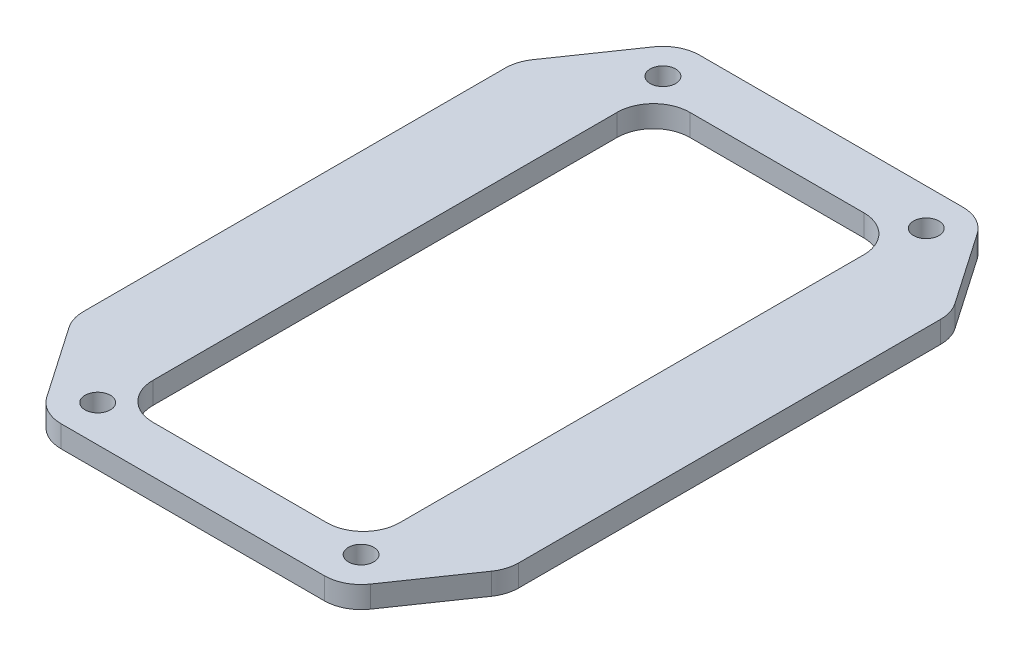
ISO-10303-21;
HEADER;
FILE_DESCRIPTION(('STEP AP214'),'2;1');
FILE_NAME('part.step','',(''),(''),'','','');
FILE_SCHEMA(('AUTOMOTIVE_DESIGN { 1 0 10303 214 1 1 1 1 }'));
ENDSEC;
DATA;
#1=APPLICATION_CONTEXT('core data for automotive mechanical design processes');
#2=APPLICATION_PROTOCOL_DEFINITION('international standard','automotive_design',2000,#1);
#3=PRODUCT_CONTEXT('',#1,'mechanical');
#4=PRODUCT('Part','Part','',(#3));
#5=PRODUCT_RELATED_PRODUCT_CATEGORY('part','',(#4));
#6=PRODUCT_DEFINITION_FORMATION('','',#4);
#7=PRODUCT_DEFINITION_CONTEXT('part definition',#1,'design');
#8=PRODUCT_DEFINITION('design','',#6,#7);
#9=PRODUCT_DEFINITION_SHAPE('','',#8);
#10=(LENGTH_UNIT() NAMED_UNIT(*) SI_UNIT(.MILLI.,.METRE.));
#11=(NAMED_UNIT(*) PLANE_ANGLE_UNIT() SI_UNIT($,.RADIAN.));
#12=(NAMED_UNIT(*) SI_UNIT($,.STERADIAN.) SOLID_ANGLE_UNIT());
#13=UNCERTAINTY_MEASURE_WITH_UNIT(LENGTH_MEASURE(1.E-05),#10,'distance_accuracy_value','');
#14=(GEOMETRIC_REPRESENTATION_CONTEXT(3) GLOBAL_UNCERTAINTY_ASSIGNED_CONTEXT((#13)) GLOBAL_UNIT_ASSIGNED_CONTEXT((#10,
#11,#12)) REPRESENTATION_CONTEXT('',''));
#15=CARTESIAN_POINT('',(0.,0.,0.));
#16=DIRECTION('',(0.,0.,1.));
#17=DIRECTION('',(1.,0.,0.));
#18=AXIS2_PLACEMENT_3D('',#15,#16,#17);
#19=CARTESIAN_POINT('',(0.,3.,0.));
#20=DIRECTION('',(0.,-1.,0.));
#21=DIRECTION('',(0.,0.,-1.));
#22=AXIS2_PLACEMENT_3D('',#19,#20,#21);
#23=PLANE('',#22);
#24=CARTESIAN_POINT('',(11.85,3.,-5.04999999999999));
#25=DIRECTION('',(0.,1.,0.));
#26=DIRECTION('',(0.,0.,1.));
#27=AXIS2_PLACEMENT_3D('',#24,#25,#26);
#28=CIRCLE('',#27,1.75);
#29=CARTESIAN_POINT('',(11.85,3.,-3.29999999999999));
#30=VERTEX_POINT('',#29);
#31=EDGE_CURVE('E477',#30,#30,#28,.T.);
#32=ORIENTED_EDGE('',*,*,#31,.F.);
#33=EDGE_LOOP('',(#32));
#34=FACE_BOUND('',#33,.T.);
#35=CARTESIAN_POINT('',(11.85,3.,-82.95));
#36=DIRECTION('',(0.,1.,0.));
#37=DIRECTION('',(0.,0.,1.));
#38=AXIS2_PLACEMENT_3D('',#35,#36,#37);
#39=CIRCLE('',#38,1.75);
#40=CARTESIAN_POINT('',(11.85,3.,-81.2));
#41=VERTEX_POINT('',#40);
#42=EDGE_CURVE('E485',#41,#41,#39,.T.);
#43=ORIENTED_EDGE('',*,*,#42,.F.);
#44=EDGE_LOOP('',(#43));
#45=FACE_BOUND('',#44,.T.);
#46=CARTESIAN_POINT('',(48.15,3.,-5.05000000000003));
#47=DIRECTION('',(0.,1.,0.));
#48=DIRECTION('',(0.,0.,1.));
#49=AXIS2_PLACEMENT_3D('',#46,#47,#48);
#50=CIRCLE('',#49,1.75);
#51=CARTESIAN_POINT('',(48.15,3.,-3.30000000000003));
#52=VERTEX_POINT('',#51);
#53=EDGE_CURVE('E493',#52,#52,#50,.T.);
#54=ORIENTED_EDGE('',*,*,#53,.F.);
#55=EDGE_LOOP('',(#54));
#56=FACE_BOUND('',#55,.T.);
#57=CARTESIAN_POINT('',(48.15,3.,-82.95));
#58=DIRECTION('',(0.,1.,0.));
#59=DIRECTION('',(0.,0.,1.));
#60=AXIS2_PLACEMENT_3D('',#57,#58,#59);
#61=CIRCLE('',#60,1.75);
#62=CARTESIAN_POINT('',(48.15,3.,-81.2));
#63=VERTEX_POINT('',#62);
#64=EDGE_CURVE('E407',#63,#63,#61,.T.);
#65=ORIENTED_EDGE('',*,*,#64,.F.);
#66=EDGE_LOOP('',(#65));
#67=FACE_BOUND('',#66,.T.);
#68=DIRECTION('',(0.,0.,1.));
#69=VECTOR('',#68,1.);
#70=CARTESIAN_POINT('',(13.,3.,-80.5));
#71=LINE('',#70,#69);
#72=CARTESIAN_POINT('',(13.,3.,-75.5));
#73=VERTEX_POINT('',#72);
#74=CARTESIAN_POINT('',(13.,3.,-11.5));
#75=VERTEX_POINT('',#74);
#76=EDGE_CURVE('E452',#73,#75,#71,.T.);
#77=ORIENTED_EDGE('',*,*,#76,.F.);
#78=CARTESIAN_POINT('',(18.,3.,-75.5));
#79=DIRECTION('',(0.,-1.,0.));
#80=DIRECTION('',(0.,0.,-1.));
#81=AXIS2_PLACEMENT_3D('',#78,#79,#80);
#82=CIRCLE('',#81,5.);
#83=CARTESIAN_POINT('',(18.,3.,-80.5));
#84=VERTEX_POINT('',#83);
#85=EDGE_CURVE('E277',#73,#84,#82,.T.);
#86=ORIENTED_EDGE('',*,*,#85,.T.);
#87=DIRECTION('',(-1.,0.,0.));
#88=VECTOR('',#87,1.);
#89=CARTESIAN_POINT('',(13.,3.,-80.5));
#90=LINE('',#89,#88);
#91=CARTESIAN_POINT('',(42.,3.,-80.5));
#92=VERTEX_POINT('',#91);
#93=EDGE_CURVE('E463',#92,#84,#90,.T.);
#94=ORIENTED_EDGE('',*,*,#93,.F.);
#95=CARTESIAN_POINT('',(42.,3.,-75.5));
#96=DIRECTION('',(0.,-1.,0.));
#97=DIRECTION('',(0.,0.,-1.));
#98=AXIS2_PLACEMENT_3D('',#95,#96,#97);
#99=CIRCLE('',#98,5.);
#100=CARTESIAN_POINT('',(47.,3.,-75.5));
#101=VERTEX_POINT('',#100);
#102=EDGE_CURVE('E213',#92,#101,#99,.T.);
#103=ORIENTED_EDGE('',*,*,#102,.T.);
#104=DIRECTION('',(0.,0.,-1.));
#105=VECTOR('',#104,1.);
#106=CARTESIAN_POINT('',(47.,3.,-80.5));
#107=LINE('',#106,#105);
#108=CARTESIAN_POINT('',(47.,3.,-11.5));
#109=VERTEX_POINT('',#108);
#110=EDGE_CURVE('E460',#109,#101,#107,.T.);
#111=ORIENTED_EDGE('',*,*,#110,.F.);
#112=CARTESIAN_POINT('',(42.,3.,-11.5));
#113=DIRECTION('',(0.,-1.,0.));
#114=DIRECTION('',(0.,0.,-1.));
#115=AXIS2_PLACEMENT_3D('',#112,#113,#114);
#116=CIRCLE('',#115,5.);
#117=CARTESIAN_POINT('',(42.,3.,-6.49999999999999));
#118=VERTEX_POINT('',#117);
#119=EDGE_CURVE('E212',#109,#118,#116,.T.);
#120=ORIENTED_EDGE('',*,*,#119,.T.);
#121=DIRECTION('',(1.,0.,0.));
#122=VECTOR('',#121,1.);
#123=CARTESIAN_POINT('',(13.,3.,-6.49999999999999));
#124=LINE('',#123,#122);
#125=CARTESIAN_POINT('',(18.,3.,-6.49999999999999));
#126=VERTEX_POINT('',#125);
#127=EDGE_CURVE('E456',#126,#118,#124,.T.);
#128=ORIENTED_EDGE('',*,*,#127,.F.);
#129=CARTESIAN_POINT('',(18.,3.,-11.5));
#130=DIRECTION('',(0.,-1.,0.));
#131=DIRECTION('',(0.,0.,-1.));
#132=AXIS2_PLACEMENT_3D('',#129,#130,#131);
#133=CIRCLE('',#132,5.);
#134=EDGE_CURVE('E271',#126,#75,#133,.T.);
#135=ORIENTED_EDGE('',*,*,#134,.T.);
#136=EDGE_LOOP('',(#77,#86,#94,#103,#111,#120,#128,#135));
#137=FACE_BOUND('',#136,.T.);
#138=DIRECTION('',(-0.56730108222644,0.,0.823510462656493));
#139=VECTOR('',#138,1.);
#140=CARTESIAN_POINT('',(9.1965673675746,3.,-88.));
#141=LINE('',#140,#139);
#142=CARTESIAN_POINT('',(7.69127216358472,3.,-85.8148704652435));
#143=VERTEX_POINT('',#142);
#144=CARTESIAN_POINT('',(0.891272163584712,3.,-75.9437961424398));
#145=VERTEX_POINT('',#144);
#146=EDGE_CURVE('E429',#143,#145,#141,.T.);
#147=ORIENTED_EDGE('',*,*,#146,.T.);
#148=CARTESIAN_POINT('',(5.05,3.,-73.0789256771963));
#149=DIRECTION('',(0.,-1.,0.));
#150=DIRECTION('',(0.,0.,-1.));
#151=AXIS2_PLACEMENT_3D('',#148,#149,#150);
#152=CIRCLE('',#151,5.05);
#153=CARTESIAN_POINT('',(0.,3.,-73.0789256771963));
#154=VERTEX_POINT('',#153);
#155=EDGE_CURVE('E308',#145,#154,#152,.F.);
#156=ORIENTED_EDGE('',*,*,#155,.T.);
#157=DIRECTION('',(0.,0.,1.));
#158=VECTOR('',#157,1.);
#159=CARTESIAN_POINT('',(0.,3.,0.));
#160=LINE('',#159,#158);
#161=CARTESIAN_POINT('',(0.,3.,-14.9210743228037));
#162=VERTEX_POINT('',#161);
#163=EDGE_CURVE('E393',#154,#162,#160,.T.);
#164=ORIENTED_EDGE('',*,*,#163,.T.);
#165=CARTESIAN_POINT('',(5.05,3.,-14.9210743228037));
#166=DIRECTION('',(0.,-1.,0.));
#167=DIRECTION('',(0.,0.,-1.));
#168=AXIS2_PLACEMENT_3D('',#165,#166,#167);
#169=CIRCLE('',#168,5.05);
#170=CARTESIAN_POINT('',(0.891272163584712,3.,-12.0562038575602));
#171=VERTEX_POINT('',#170);
#172=EDGE_CURVE('E287',#162,#171,#169,.F.);
#173=ORIENTED_EDGE('',*,*,#172,.T.);
#174=DIRECTION('',(0.567301082226439,0.,0.823510462656493));
#175=VECTOR('',#174,1.);
#176=CARTESIAN_POINT('',(0.,3.,-13.35));
#177=LINE('',#176,#175);
#178=CARTESIAN_POINT('',(7.69127216358472,3.,-2.18512953475648));
#179=VERTEX_POINT('',#178);
#180=EDGE_CURVE('E436',#171,#179,#177,.T.);
#181=ORIENTED_EDGE('',*,*,#180,.T.);
#182=CARTESIAN_POINT('',(11.85,3.,-5.05));
#183=DIRECTION('',(0.,-1.,0.));
#184=DIRECTION('',(0.,0.,-1.));
#185=AXIS2_PLACEMENT_3D('',#182,#183,#184);
#186=CIRCLE('',#185,5.05);
#187=CARTESIAN_POINT('',(11.85,3.,0.));
#188=VERTEX_POINT('',#187);
#189=EDGE_CURVE('E290',#179,#188,#186,.F.);
#190=ORIENTED_EDGE('',*,*,#189,.T.);
#191=DIRECTION('',(1.,0.,0.));
#192=VECTOR('',#191,1.);
#193=CARTESIAN_POINT('',(0.,3.,0.));
#194=LINE('',#193,#192);
#195=CARTESIAN_POINT('',(48.15,3.,0.));
#196=VERTEX_POINT('',#195);
#197=EDGE_CURVE('E382',#188,#196,#194,.T.);
#198=ORIENTED_EDGE('',*,*,#197,.T.);
#199=CARTESIAN_POINT('',(48.15,3.,-5.05));
#200=DIRECTION('',(0.,-1.,0.));
#201=DIRECTION('',(0.,0.,-1.));
#202=AXIS2_PLACEMENT_3D('',#199,#200,#201);
#203=CIRCLE('',#202,5.05);
#204=CARTESIAN_POINT('',(52.3087278364153,3.,-2.18512953475648));
#205=VERTEX_POINT('',#204);
#206=EDGE_CURVE('E293',#196,#205,#203,.F.);
#207=ORIENTED_EDGE('',*,*,#206,.T.);
#208=DIRECTION('',(0.56730108222644,0.,-0.823510462656493));
#209=VECTOR('',#208,1.);
#210=CARTESIAN_POINT('',(50.8034326324254,3.,0.));
#211=LINE('',#210,#209);
#212=CARTESIAN_POINT('',(59.1087278364153,3.,-12.0562038575602));
#213=VERTEX_POINT('',#212);
#214=EDGE_CURVE('E439',#205,#213,#211,.T.);
#215=ORIENTED_EDGE('',*,*,#214,.T.);
#216=CARTESIAN_POINT('',(54.95,3.,-14.9210743228037));
#217=DIRECTION('',(0.,-1.,0.));
#218=DIRECTION('',(0.,0.,-1.));
#219=AXIS2_PLACEMENT_3D('',#216,#217,#218);
#220=CIRCLE('',#219,5.05);
#221=CARTESIAN_POINT('',(60.,3.,-14.9210743228037));
#222=VERTEX_POINT('',#221);
#223=EDGE_CURVE('E296',#213,#222,#220,.F.);
#224=ORIENTED_EDGE('',*,*,#223,.T.);
#225=DIRECTION('',(0.,0.,-1.));
#226=VECTOR('',#225,1.);
#227=CARTESIAN_POINT('',(60.,3.,0.));
#228=LINE('',#227,#226);
#229=CARTESIAN_POINT('',(60.,3.,-73.0789256771963));
#230=VERTEX_POINT('',#229);
#231=EDGE_CURVE('E236',#222,#230,#228,.T.);
#232=ORIENTED_EDGE('',*,*,#231,.T.);
#233=CARTESIAN_POINT('',(54.95,3.,-73.0789256771963));
#234=DIRECTION('',(0.,-1.,0.));
#235=DIRECTION('',(0.,0.,-1.));
#236=AXIS2_PLACEMENT_3D('',#233,#234,#235);
#237=CIRCLE('',#236,5.05);
#238=CARTESIAN_POINT('',(59.1087278364153,3.,-75.9437961424398));
#239=VERTEX_POINT('',#238);
#240=EDGE_CURVE('E299',#230,#239,#237,.F.);
#241=ORIENTED_EDGE('',*,*,#240,.T.);
#242=DIRECTION('',(-0.56730108222644,0.,-0.823510462656493));
#243=VECTOR('',#242,1.);
#244=CARTESIAN_POINT('',(60.,3.,-74.65));
#245=LINE('',#244,#243);
#246=CARTESIAN_POINT('',(52.3087278364153,3.,-85.8148704652435));
#247=VERTEX_POINT('',#246);
#248=EDGE_CURVE('E447',#239,#247,#245,.T.);
#249=ORIENTED_EDGE('',*,*,#248,.T.);
#250=CARTESIAN_POINT('',(48.15,3.,-82.95));
#251=DIRECTION('',(0.,-1.,0.));
#252=DIRECTION('',(0.,0.,-1.));
#253=AXIS2_PLACEMENT_3D('',#250,#251,#252);
#254=CIRCLE('',#253,5.05);
#255=CARTESIAN_POINT('',(48.15,3.,-88.));
#256=VERTEX_POINT('',#255);
#257=EDGE_CURVE('E302',#247,#256,#254,.F.);
#258=ORIENTED_EDGE('',*,*,#257,.T.);
#259=DIRECTION('',(-1.,0.,0.));
#260=VECTOR('',#259,1.);
#261=CARTESIAN_POINT('',(0.,3.,-88.));
#262=LINE('',#261,#260);
#263=CARTESIAN_POINT('',(11.85,3.,-88.));
#264=VERTEX_POINT('',#263);
#265=EDGE_CURVE('E229',#256,#264,#262,.T.);
#266=ORIENTED_EDGE('',*,*,#265,.T.);
#267=CARTESIAN_POINT('',(11.85,3.,-82.95));
#268=DIRECTION('',(0.,-1.,0.));
#269=DIRECTION('',(0.,0.,-1.));
#270=AXIS2_PLACEMENT_3D('',#267,#268,#269);
#271=CIRCLE('',#270,5.05);
#272=EDGE_CURVE('E305',#264,#143,#271,.F.);
#273=ORIENTED_EDGE('',*,*,#272,.T.);
#274=EDGE_LOOP('',(#147,#156,#164,#173,#181,#190,#198,#207,#215,#224,#232,#241,#249,#258,#266,#273));
#275=FACE_BOUND('',#274,.T.);
#276=ADVANCED_FACE('F38',(#34,#45,#56,#67,#137,#275),#23,.F.);
#277=CARTESIAN_POINT('',(0.,0.,0.));
#278=DIRECTION('',(0.,-1.,0.));
#279=DIRECTION('',(0.,0.,-1.));
#280=AXIS2_PLACEMENT_3D('',#277,#278,#279);
#281=PLANE('',#280);
#282=CARTESIAN_POINT('',(11.85,0.,-82.95));
#283=DIRECTION('',(0.,1.,0.));
#284=DIRECTION('',(0.,0.,1.));
#285=AXIS2_PLACEMENT_3D('',#282,#283,#284);
#286=CIRCLE('',#285,1.75);
#287=CARTESIAN_POINT('',(11.85,0.,-81.2));
#288=VERTEX_POINT('',#287);
#289=EDGE_CURVE('E481',#288,#288,#286,.T.);
#290=ORIENTED_EDGE('',*,*,#289,.T.);
#291=EDGE_LOOP('',(#290));
#292=FACE_BOUND('',#291,.T.);
#293=CARTESIAN_POINT('',(48.15,0.,-82.95));
#294=DIRECTION('',(0.,1.,0.));
#295=DIRECTION('',(0.,0.,1.));
#296=AXIS2_PLACEMENT_3D('',#293,#294,#295);
#297=CIRCLE('',#296,1.75);
#298=CARTESIAN_POINT('',(48.15,0.,-81.2));
#299=VERTEX_POINT('',#298);
#300=EDGE_CURVE('E497',#299,#299,#297,.T.);
#301=ORIENTED_EDGE('',*,*,#300,.T.);
#302=EDGE_LOOP('',(#301));
#303=FACE_BOUND('',#302,.T.);
#304=CARTESIAN_POINT('',(48.15,0.,-5.05000000000003));
#305=DIRECTION('',(0.,1.,0.));
#306=DIRECTION('',(0.,0.,1.));
#307=AXIS2_PLACEMENT_3D('',#304,#305,#306);
#308=CIRCLE('',#307,1.75);
#309=CARTESIAN_POINT('',(48.15,0.,-3.30000000000003));
#310=VERTEX_POINT('',#309);
#311=EDGE_CURVE('E489',#310,#310,#308,.T.);
#312=ORIENTED_EDGE('',*,*,#311,.T.);
#313=EDGE_LOOP('',(#312));
#314=FACE_BOUND('',#313,.T.);
#315=CARTESIAN_POINT('',(11.85,0.,-5.04999999999999));
#316=DIRECTION('',(0.,1.,0.));
#317=DIRECTION('',(0.,0.,1.));
#318=AXIS2_PLACEMENT_3D('',#315,#316,#317);
#319=CIRCLE('',#318,1.75);
#320=CARTESIAN_POINT('',(11.85,0.,-3.29999999999999));
#321=VERTEX_POINT('',#320);
#322=EDGE_CURVE('E467',#321,#321,#319,.T.);
#323=ORIENTED_EDGE('',*,*,#322,.T.);
#324=EDGE_LOOP('',(#323));
#325=FACE_BOUND('',#324,.T.);
#326=DIRECTION('',(0.,0.,-1.));
#327=VECTOR('',#326,1.);
#328=CARTESIAN_POINT('',(47.,0.,-80.5));
#329=LINE('',#328,#327);
#330=CARTESIAN_POINT('',(47.,0.,-11.5));
#331=VERTEX_POINT('',#330);
#332=CARTESIAN_POINT('',(47.,0.,-75.5));
#333=VERTEX_POINT('',#332);
#334=EDGE_CURVE('E204',#331,#333,#329,.T.);
#335=ORIENTED_EDGE('',*,*,#334,.T.);
#336=CARTESIAN_POINT('',(42.,0.,-75.5));
#337=DIRECTION('',(0.,-1.,0.));
#338=DIRECTION('',(0.,0.,-1.));
#339=AXIS2_PLACEMENT_3D('',#336,#337,#338);
#340=CIRCLE('',#339,5.);
#341=CARTESIAN_POINT('',(42.,0.,-80.5));
#342=VERTEX_POINT('',#341);
#343=EDGE_CURVE('E261',#333,#342,#340,.F.);
#344=ORIENTED_EDGE('',*,*,#343,.T.);
#345=DIRECTION('',(-1.,0.,0.));
#346=VECTOR('',#345,1.);
#347=CARTESIAN_POINT('',(13.,0.,-80.5));
#348=LINE('',#347,#346);
#349=CARTESIAN_POINT('',(18.,0.,-80.5));
#350=VERTEX_POINT('',#349);
#351=EDGE_CURVE('E224',#342,#350,#348,.T.);
#352=ORIENTED_EDGE('',*,*,#351,.T.);
#353=CARTESIAN_POINT('',(18.,0.,-75.5));
#354=DIRECTION('',(0.,-1.,0.));
#355=DIRECTION('',(0.,0.,-1.));
#356=AXIS2_PLACEMENT_3D('',#353,#354,#355);
#357=CIRCLE('',#356,5.);
#358=CARTESIAN_POINT('',(13.,0.,-75.5));
#359=VERTEX_POINT('',#358);
#360=EDGE_CURVE('E274',#350,#359,#357,.F.);
#361=ORIENTED_EDGE('',*,*,#360,.T.);
#362=DIRECTION('',(0.,0.,1.));
#363=VECTOR('',#362,1.);
#364=CARTESIAN_POINT('',(13.,0.,-80.5));
#365=LINE('',#364,#363);
#366=CARTESIAN_POINT('',(13.,0.,-11.5));
#367=VERTEX_POINT('',#366);
#368=EDGE_CURVE('E468',#359,#367,#365,.T.);
#369=ORIENTED_EDGE('',*,*,#368,.T.);
#370=CARTESIAN_POINT('',(18.,0.,-11.5));
#371=DIRECTION('',(0.,-1.,0.));
#372=DIRECTION('',(0.,0.,-1.));
#373=AXIS2_PLACEMENT_3D('',#370,#371,#372);
#374=CIRCLE('',#373,5.);
#375=CARTESIAN_POINT('',(18.,0.,-6.49999999999999));
#376=VERTEX_POINT('',#375);
#377=EDGE_CURVE('E268',#367,#376,#374,.F.);
#378=ORIENTED_EDGE('',*,*,#377,.T.);
#379=DIRECTION('',(1.,0.,0.));
#380=VECTOR('',#379,1.);
#381=CARTESIAN_POINT('',(13.,0.,-6.49999999999999));
#382=LINE('',#381,#380);
#383=CARTESIAN_POINT('',(42.,0.,-6.49999999999999));
#384=VERTEX_POINT('',#383);
#385=EDGE_CURVE('E206',#376,#384,#382,.T.);
#386=ORIENTED_EDGE('',*,*,#385,.T.);
#387=CARTESIAN_POINT('',(42.,0.,-11.5));
#388=DIRECTION('',(0.,-1.,0.));
#389=DIRECTION('',(0.,0.,-1.));
#390=AXIS2_PLACEMENT_3D('',#387,#388,#389);
#391=CIRCLE('',#390,5.);
#392=EDGE_CURVE('E201',#384,#331,#391,.F.);
#393=ORIENTED_EDGE('',*,*,#392,.T.);
#394=EDGE_LOOP('',(#335,#344,#352,#361,#369,#378,#386,#393));
#395=FACE_BOUND('',#394,.T.);
#396=DIRECTION('',(0.,0.,1.));
#397=VECTOR('',#396,1.);
#398=CARTESIAN_POINT('',(0.,0.,0.));
#399=LINE('',#398,#397);
#400=CARTESIAN_POINT('',(0.,0.,-73.0789256771963));
#401=VERTEX_POINT('',#400);
#402=CARTESIAN_POINT('',(0.,0.,-14.9210743228037));
#403=VERTEX_POINT('',#402);
#404=EDGE_CURVE('E403',#401,#403,#399,.T.);
#405=ORIENTED_EDGE('',*,*,#404,.F.);
#406=CARTESIAN_POINT('',(5.05,0.,-73.0789256771963));
#407=DIRECTION('',(0.,-1.,0.));
#408=DIRECTION('',(0.,0.,-1.));
#409=AXIS2_PLACEMENT_3D('',#406,#407,#408);
#410=CIRCLE('',#409,5.05);
#411=CARTESIAN_POINT('',(0.891272163584712,0.,-75.9437961424398));
#412=VERTEX_POINT('',#411);
#413=EDGE_CURVE('E338',#401,#412,#410,.T.);
#414=ORIENTED_EDGE('',*,*,#413,.T.);
#415=DIRECTION('',(-0.56730108222644,0.,0.823510462656493));
#416=VECTOR('',#415,1.);
#417=CARTESIAN_POINT('',(9.1965673675746,0.,-88.));
#418=LINE('',#417,#416);
#419=CARTESIAN_POINT('',(7.69127216358472,0.,-85.8148704652435));
#420=VERTEX_POINT('',#419);
#421=EDGE_CURVE('E451',#420,#412,#418,.T.);
#422=ORIENTED_EDGE('',*,*,#421,.F.);
#423=CARTESIAN_POINT('',(11.85,0.,-82.95));
#424=DIRECTION('',(0.,-1.,0.));
#425=DIRECTION('',(0.,0.,-1.));
#426=AXIS2_PLACEMENT_3D('',#423,#424,#425);
#427=CIRCLE('',#426,5.05);
#428=CARTESIAN_POINT('',(11.85,0.,-88.));
#429=VERTEX_POINT('',#428);
#430=EDGE_CURVE('E335',#420,#429,#427,.T.);
#431=ORIENTED_EDGE('',*,*,#430,.T.);
#432=DIRECTION('',(-1.,0.,0.));
#433=VECTOR('',#432,1.);
#434=CARTESIAN_POINT('',(0.,0.,-88.));
#435=LINE('',#434,#433);
#436=CARTESIAN_POINT('',(48.15,0.,-88.));
#437=VERTEX_POINT('',#436);
#438=EDGE_CURVE('E239',#437,#429,#435,.T.);
#439=ORIENTED_EDGE('',*,*,#438,.F.);
#440=CARTESIAN_POINT('',(48.15,0.,-82.95));
#441=DIRECTION('',(0.,-1.,0.));
#442=DIRECTION('',(0.,0.,-1.));
#443=AXIS2_PLACEMENT_3D('',#440,#441,#442);
#444=CIRCLE('',#443,5.05);
#445=CARTESIAN_POINT('',(52.3087278364153,0.,-85.8148704652435));
#446=VERTEX_POINT('',#445);
#447=EDGE_CURVE('E332',#437,#446,#444,.T.);
#448=ORIENTED_EDGE('',*,*,#447,.T.);
#449=DIRECTION('',(-0.56730108222644,0.,-0.823510462656493));
#450=VECTOR('',#449,1.);
#451=CARTESIAN_POINT('',(60.,0.,-74.65));
#452=LINE('',#451,#450);
#453=CARTESIAN_POINT('',(59.1087278364153,0.,-75.9437961424398));
#454=VERTEX_POINT('',#453);
#455=EDGE_CURVE('E442',#454,#446,#452,.T.);
#456=ORIENTED_EDGE('',*,*,#455,.F.);
#457=CARTESIAN_POINT('',(54.95,0.,-73.0789256771963));
#458=DIRECTION('',(0.,-1.,0.));
#459=DIRECTION('',(0.,0.,-1.));
#460=AXIS2_PLACEMENT_3D('',#457,#458,#459);
#461=CIRCLE('',#460,5.05);
#462=CARTESIAN_POINT('',(60.,0.,-73.0789256771963));
#463=VERTEX_POINT('',#462);
#464=EDGE_CURVE('E329',#454,#463,#461,.T.);
#465=ORIENTED_EDGE('',*,*,#464,.T.);
#466=DIRECTION('',(0.,0.,-1.));
#467=VECTOR('',#466,1.);
#468=CARTESIAN_POINT('',(60.,0.,0.));
#469=LINE('',#468,#467);
#470=CARTESIAN_POINT('',(60.,0.,-14.9210743228037));
#471=VERTEX_POINT('',#470);
#472=EDGE_CURVE('E409',#471,#463,#469,.T.);
#473=ORIENTED_EDGE('',*,*,#472,.F.);
#474=CARTESIAN_POINT('',(54.95,0.,-14.9210743228037));
#475=DIRECTION('',(0.,-1.,0.));
#476=DIRECTION('',(0.,0.,-1.));
#477=AXIS2_PLACEMENT_3D('',#474,#475,#476);
#478=CIRCLE('',#477,5.05);
#479=CARTESIAN_POINT('',(59.1087278364153,0.,-12.0562038575602));
#480=VERTEX_POINT('',#479);
#481=EDGE_CURVE('E326',#471,#480,#478,.T.);
#482=ORIENTED_EDGE('',*,*,#481,.T.);
#483=DIRECTION('',(0.56730108222644,0.,-0.823510462656493));
#484=VECTOR('',#483,1.);
#485=CARTESIAN_POINT('',(50.8034326324254,0.,0.));
#486=LINE('',#485,#484);
#487=CARTESIAN_POINT('',(52.3087278364153,0.,-2.18512953475648));
#488=VERTEX_POINT('',#487);
#489=EDGE_CURVE('E594',#488,#480,#486,.T.);
#490=ORIENTED_EDGE('',*,*,#489,.F.);
#491=CARTESIAN_POINT('',(48.15,0.,-5.05));
#492=DIRECTION('',(0.,-1.,0.));
#493=DIRECTION('',(0.,0.,-1.));
#494=AXIS2_PLACEMENT_3D('',#491,#492,#493);
#495=CIRCLE('',#494,5.05);
#496=CARTESIAN_POINT('',(48.15,0.,0.));
#497=VERTEX_POINT('',#496);
#498=EDGE_CURVE('E323',#488,#497,#495,.T.);
#499=ORIENTED_EDGE('',*,*,#498,.T.);
#500=DIRECTION('',(1.,0.,0.));
#501=VECTOR('',#500,1.);
#502=CARTESIAN_POINT('',(0.,0.,0.));
#503=LINE('',#502,#501);
#504=CARTESIAN_POINT('',(11.85,0.,0.));
#505=VERTEX_POINT('',#504);
#506=EDGE_CURVE('E384',#505,#497,#503,.T.);
#507=ORIENTED_EDGE('',*,*,#506,.F.);
#508=CARTESIAN_POINT('',(11.85,0.,-5.05));
#509=DIRECTION('',(0.,-1.,0.));
#510=DIRECTION('',(0.,0.,-1.));
#511=AXIS2_PLACEMENT_3D('',#508,#509,#510);
#512=CIRCLE('',#511,5.05);
#513=CARTESIAN_POINT('',(7.69127216358472,0.,-2.18512953475648));
#514=VERTEX_POINT('',#513);
#515=EDGE_CURVE('E54',#505,#514,#512,.T.);
#516=ORIENTED_EDGE('',*,*,#515,.T.);
#517=DIRECTION('',(0.567301082226439,0.,0.823510462656493));
#518=VECTOR('',#517,1.);
#519=CARTESIAN_POINT('',(0.,0.,-13.35));
#520=LINE('',#519,#518);
#521=CARTESIAN_POINT('',(0.891272163584712,0.,-12.0562038575602));
#522=VERTEX_POINT('',#521);
#523=EDGE_CURVE('E586',#522,#514,#520,.T.);
#524=ORIENTED_EDGE('',*,*,#523,.F.);
#525=CARTESIAN_POINT('',(5.05,0.,-14.9210743228037));
#526=DIRECTION('',(0.,-1.,0.));
#527=DIRECTION('',(0.,0.,-1.));
#528=AXIS2_PLACEMENT_3D('',#525,#526,#527);
#529=CIRCLE('',#528,5.05);
#530=EDGE_CURVE('E318',#522,#403,#529,.T.);
#531=ORIENTED_EDGE('',*,*,#530,.T.);
#532=EDGE_LOOP('',(#405,#414,#422,#431,#439,#448,#456,#465,#473,#482,#490,#499,#507,#516,#524,#531));
#533=FACE_BOUND('',#532,.T.);
#534=ADVANCED_FACE('F203',(#292,#303,#314,#325,#395,#533),#281,.T.);
#535=CARTESIAN_POINT('',(0.,3.,0.));
#536=DIRECTION('',(1.,0.,0.));
#537=DIRECTION('',(0.,0.,-1.));
#538=AXIS2_PLACEMENT_3D('',#535,#536,#537);
#539=PLANE('',#538);
#540=ORIENTED_EDGE('',*,*,#163,.F.);
#541=DIRECTION('',(0.,1.,0.));
#542=VECTOR('',#541,1.);
#543=CARTESIAN_POINT('',(0.,0.,-73.0789256771963));
#544=LINE('',#543,#542);
#545=EDGE_CURVE('E315',#154,#401,#544,.F.);
#546=ORIENTED_EDGE('',*,*,#545,.T.);
#547=ORIENTED_EDGE('',*,*,#404,.T.);
#548=DIRECTION('',(0.,1.,0.));
#549=VECTOR('',#548,1.);
#550=CARTESIAN_POINT('',(0.,3.,-14.9210743228037));
#551=LINE('',#550,#549);
#552=EDGE_CURVE('E311',#403,#162,#551,.T.);
#553=ORIENTED_EDGE('',*,*,#552,.T.);
#554=EDGE_LOOP('',(#540,#546,#547,#553));
#555=FACE_BOUND('',#554,.T.);
#556=ADVANCED_FACE('F529',(#555),#539,.F.);
#557=CARTESIAN_POINT('',(0.,3.,0.));
#558=DIRECTION('',(0.,0.,-1.));
#559=DIRECTION('',(-1.,0.,0.));
#560=AXIS2_PLACEMENT_3D('',#557,#558,#559);
#561=PLANE('',#560);
#562=ORIENTED_EDGE('',*,*,#506,.T.);
#563=DIRECTION('',(0.,1.,0.));
#564=VECTOR('',#563,1.);
#565=CARTESIAN_POINT('',(48.15,3.,0.));
#566=LINE('',#565,#564);
#567=EDGE_CURVE('E372',#497,#196,#566,.T.);
#568=ORIENTED_EDGE('',*,*,#567,.T.);
#569=ORIENTED_EDGE('',*,*,#197,.F.);
#570=DIRECTION('',(0.,1.,0.));
#571=VECTOR('',#570,1.);
#572=CARTESIAN_POINT('',(11.85,0.,0.));
#573=LINE('',#572,#571);
#574=EDGE_CURVE('E369',#188,#505,#573,.F.);
#575=ORIENTED_EDGE('',*,*,#574,.T.);
#576=EDGE_LOOP('',(#562,#568,#569,#575));
#577=FACE_BOUND('',#576,.T.);
#578=ADVANCED_FACE('F381',(#577),#561,.F.);
#579=CARTESIAN_POINT('',(60.,3.,0.));
#580=DIRECTION('',(-1.,0.,0.));
#581=DIRECTION('',(0.,0.,1.));
#582=AXIS2_PLACEMENT_3D('',#579,#580,#581);
#583=PLANE('',#582);
#584=ORIENTED_EDGE('',*,*,#472,.T.);
#585=DIRECTION('',(0.,1.,0.));
#586=VECTOR('',#585,1.);
#587=CARTESIAN_POINT('',(60.,3.,-73.0789256771963));
#588=LINE('',#587,#586);
#589=EDGE_CURVE('E358',#463,#230,#588,.T.);
#590=ORIENTED_EDGE('',*,*,#589,.T.);
#591=ORIENTED_EDGE('',*,*,#231,.F.);
#592=DIRECTION('',(0.,1.,0.));
#593=VECTOR('',#592,1.);
#594=CARTESIAN_POINT('',(60.,0.,-14.9210743228037));
#595=LINE('',#594,#593);
#596=EDGE_CURVE('E355',#222,#471,#595,.F.);
#597=ORIENTED_EDGE('',*,*,#596,.T.);
#598=EDGE_LOOP('',(#584,#590,#591,#597));
#599=FACE_BOUND('',#598,.T.);
#600=ADVANCED_FACE('F521',(#599),#583,.F.);
#601=CARTESIAN_POINT('',(0.,3.,-88.));
#602=DIRECTION('',(0.,0.,1.));
#603=DIRECTION('',(1.,0.,0.));
#604=AXIS2_PLACEMENT_3D('',#601,#602,#603);
#605=PLANE('',#604);
#606=ORIENTED_EDGE('',*,*,#438,.T.);
#607=DIRECTION('',(0.,1.,0.));
#608=VECTOR('',#607,1.);
#609=CARTESIAN_POINT('',(11.85,3.,-88.));
#610=LINE('',#609,#608);
#611=EDGE_CURVE('E344',#429,#264,#610,.T.);
#612=ORIENTED_EDGE('',*,*,#611,.T.);
#613=ORIENTED_EDGE('',*,*,#265,.F.);
#614=DIRECTION('',(0.,1.,0.));
#615=VECTOR('',#614,1.);
#616=CARTESIAN_POINT('',(48.15,0.,-88.));
#617=LINE('',#616,#615);
#618=EDGE_CURVE('E341',#256,#437,#617,.F.);
#619=ORIENTED_EDGE('',*,*,#618,.T.);
#620=EDGE_LOOP('',(#606,#612,#613,#619));
#621=FACE_BOUND('',#620,.T.);
#622=ADVANCED_FACE('F420',(#621),#605,.F.);
#623=CARTESIAN_POINT('',(48.15,3.,-82.95));
#624=DIRECTION('',(0.,-1.,0.));
#625=DIRECTION('',(0.,0.,-1.));
#626=AXIS2_PLACEMENT_3D('',#623,#624,#625);
#627=CYLINDRICAL_SURFACE('',#626,1.75);
#628=ORIENTED_EDGE('',*,*,#64,.T.);
#629=EDGE_LOOP('',(#628));
#630=FACE_BOUND('',#629,.T.);
#631=ORIENTED_EDGE('',*,*,#300,.F.);
#632=EDGE_LOOP('',(#631));
#633=FACE_BOUND('',#632,.T.);
#634=ADVANCED_FACE('F509',(#630,#633),#627,.F.);
#635=CARTESIAN_POINT('',(48.15,3.,-5.05000000000003));
#636=DIRECTION('',(0.,-1.,0.));
#637=DIRECTION('',(0.,0.,-1.));
#638=AXIS2_PLACEMENT_3D('',#635,#636,#637);
#639=CYLINDRICAL_SURFACE('',#638,1.75);
#640=ORIENTED_EDGE('',*,*,#53,.T.);
#641=EDGE_LOOP('',(#640));
#642=FACE_BOUND('',#641,.T.);
#643=ORIENTED_EDGE('',*,*,#311,.F.);
#644=EDGE_LOOP('',(#643));
#645=FACE_BOUND('',#644,.T.);
#646=ADVANCED_FACE('F511',(#642,#645),#639,.F.);
#647=CARTESIAN_POINT('',(11.85,3.,-82.95));
#648=DIRECTION('',(0.,-1.,0.));
#649=DIRECTION('',(0.,0.,-1.));
#650=AXIS2_PLACEMENT_3D('',#647,#648,#649);
#651=CYLINDRICAL_SURFACE('',#650,1.75);
#652=ORIENTED_EDGE('',*,*,#42,.T.);
#653=EDGE_LOOP('',(#652));
#654=FACE_BOUND('',#653,.T.);
#655=ORIENTED_EDGE('',*,*,#289,.F.);
#656=EDGE_LOOP('',(#655));
#657=FACE_BOUND('',#656,.T.);
#658=ADVANCED_FACE('F518',(#654,#657),#651,.F.);
#659=CARTESIAN_POINT('',(11.85,3.,-5.04999999999999));
#660=DIRECTION('',(0.,-1.,0.));
#661=DIRECTION('',(0.,0.,-1.));
#662=AXIS2_PLACEMENT_3D('',#659,#660,#661);
#663=CYLINDRICAL_SURFACE('',#662,1.75);
#664=ORIENTED_EDGE('',*,*,#31,.T.);
#665=EDGE_LOOP('',(#664));
#666=FACE_BOUND('',#665,.T.);
#667=ORIENTED_EDGE('',*,*,#322,.F.);
#668=EDGE_LOOP('',(#667));
#669=FACE_BOUND('',#668,.T.);
#670=ADVANCED_FACE('F640',(#666,#669),#663,.F.);
#671=CARTESIAN_POINT('',(13.,3.,-80.5));
#672=DIRECTION('',(1.,0.,0.));
#673=DIRECTION('',(0.,0.,-1.));
#674=AXIS2_PLACEMENT_3D('',#671,#672,#673);
#675=PLANE('',#674);
#676=ORIENTED_EDGE('',*,*,#76,.T.);
#677=DIRECTION('',(0.,-1.,0.));
#678=VECTOR('',#677,1.);
#679=CARTESIAN_POINT('',(13.,0.,-11.5));
#680=LINE('',#679,#678);
#681=EDGE_CURVE('E257',#75,#367,#680,.T.);
#682=ORIENTED_EDGE('',*,*,#681,.T.);
#683=ORIENTED_EDGE('',*,*,#368,.F.);
#684=DIRECTION('',(0.,-1.,0.));
#685=VECTOR('',#684,1.);
#686=CARTESIAN_POINT('',(13.,3.,-75.5));
#687=LINE('',#686,#685);
#688=EDGE_CURVE('E254',#359,#73,#687,.F.);
#689=ORIENTED_EDGE('',*,*,#688,.T.);
#690=EDGE_LOOP('',(#676,#682,#683,#689));
#691=FACE_BOUND('',#690,.T.);
#692=ADVANCED_FACE('F636',(#691),#675,.T.);
#693=CARTESIAN_POINT('',(13.,3.,-6.49999999999999));
#694=DIRECTION('',(0.,0.,-1.));
#695=DIRECTION('',(-1.,0.,0.));
#696=AXIS2_PLACEMENT_3D('',#693,#694,#695);
#697=PLANE('',#696);
#698=ORIENTED_EDGE('',*,*,#127,.T.);
#699=DIRECTION('',(0.,-1.,0.));
#700=VECTOR('',#699,1.);
#701=CARTESIAN_POINT('',(42.,0.,-6.49999999999999));
#702=LINE('',#701,#700);
#703=EDGE_CURVE('E251',#118,#384,#702,.T.);
#704=ORIENTED_EDGE('',*,*,#703,.T.);
#705=ORIENTED_EDGE('',*,*,#385,.F.);
#706=DIRECTION('',(0.,-1.,0.));
#707=VECTOR('',#706,1.);
#708=CARTESIAN_POINT('',(18.,3.,-6.49999999999999));
#709=LINE('',#708,#707);
#710=EDGE_CURVE('E248',#376,#126,#709,.F.);
#711=ORIENTED_EDGE('',*,*,#710,.T.);
#712=EDGE_LOOP('',(#698,#704,#705,#711));
#713=FACE_BOUND('',#712,.T.);
#714=ADVANCED_FACE('F633',(#713),#697,.T.);
#715=CARTESIAN_POINT('',(47.,3.,-80.5));
#716=DIRECTION('',(-1.,0.,0.));
#717=DIRECTION('',(0.,0.,1.));
#718=AXIS2_PLACEMENT_3D('',#715,#716,#717);
#719=PLANE('',#718);
#720=ORIENTED_EDGE('',*,*,#110,.T.);
#721=DIRECTION('',(0.,-1.,0.));
#722=VECTOR('',#721,1.);
#723=CARTESIAN_POINT('',(47.,0.,-75.5));
#724=LINE('',#723,#722);
#725=EDGE_CURVE('E222',#101,#333,#724,.T.);
#726=ORIENTED_EDGE('',*,*,#725,.T.);
#727=ORIENTED_EDGE('',*,*,#334,.F.);
#728=DIRECTION('',(0.,-1.,0.));
#729=VECTOR('',#728,1.);
#730=CARTESIAN_POINT('',(47.,3.,-11.5));
#731=LINE('',#730,#729);
#732=EDGE_CURVE('E219',#331,#109,#731,.F.);
#733=ORIENTED_EDGE('',*,*,#732,.T.);
#734=EDGE_LOOP('',(#720,#726,#727,#733));
#735=FACE_BOUND('',#734,.T.);
#736=ADVANCED_FACE('F218',(#735),#719,.T.);
#737=CARTESIAN_POINT('',(13.,3.,-80.5));
#738=DIRECTION('',(0.,0.,1.));
#739=DIRECTION('',(1.,0.,0.));
#740=AXIS2_PLACEMENT_3D('',#737,#738,#739);
#741=PLANE('',#740);
#742=ORIENTED_EDGE('',*,*,#351,.F.);
#743=DIRECTION('',(0.,-1.,0.));
#744=VECTOR('',#743,1.);
#745=CARTESIAN_POINT('',(42.,3.,-80.5));
#746=LINE('',#745,#744);
#747=EDGE_CURVE('E245',#342,#92,#746,.F.);
#748=ORIENTED_EDGE('',*,*,#747,.T.);
#749=ORIENTED_EDGE('',*,*,#93,.T.);
#750=DIRECTION('',(0.,-1.,0.));
#751=VECTOR('',#750,1.);
#752=CARTESIAN_POINT('',(18.,0.,-80.5));
#753=LINE('',#752,#751);
#754=EDGE_CURVE('E233',#84,#350,#753,.T.);
#755=ORIENTED_EDGE('',*,*,#754,.T.);
#756=EDGE_LOOP('',(#742,#748,#749,#755));
#757=FACE_BOUND('',#756,.T.);
#758=ADVANCED_FACE('F545',(#757),#741,.T.);
#759=CARTESIAN_POINT('',(42.,3.,-75.5));
#760=DIRECTION('',(0.,1.,0.));
#761=DIRECTION('',(0.,0.,1.));
#762=AXIS2_PLACEMENT_3D('',#759,#760,#761);
#763=CYLINDRICAL_SURFACE('',#762,5.);
#764=ORIENTED_EDGE('',*,*,#102,.F.);
#765=ORIENTED_EDGE('',*,*,#747,.F.);
#766=ORIENTED_EDGE('',*,*,#343,.F.);
#767=ORIENTED_EDGE('',*,*,#725,.F.);
#768=EDGE_LOOP('',(#764,#765,#766,#767));
#769=FACE_BOUND('',#768,.T.);
#770=ADVANCED_FACE('F542',(#769),#763,.F.);
#771=CARTESIAN_POINT('',(42.,3.,-11.5));
#772=DIRECTION('',(0.,1.,0.));
#773=DIRECTION('',(0.,0.,1.));
#774=AXIS2_PLACEMENT_3D('',#771,#772,#773);
#775=CYLINDRICAL_SURFACE('',#774,5.);
#776=ORIENTED_EDGE('',*,*,#119,.F.);
#777=ORIENTED_EDGE('',*,*,#732,.F.);
#778=ORIENTED_EDGE('',*,*,#392,.F.);
#779=ORIENTED_EDGE('',*,*,#703,.F.);
#780=EDGE_LOOP('',(#776,#777,#778,#779));
#781=FACE_BOUND('',#780,.T.);
#782=ADVANCED_FACE('F227',(#781),#775,.F.);
#783=CARTESIAN_POINT('',(18.,3.,-11.5));
#784=DIRECTION('',(0.,1.,0.));
#785=DIRECTION('',(0.,0.,1.));
#786=AXIS2_PLACEMENT_3D('',#783,#784,#785);
#787=CYLINDRICAL_SURFACE('',#786,5.);
#788=ORIENTED_EDGE('',*,*,#134,.F.);
#789=ORIENTED_EDGE('',*,*,#710,.F.);
#790=ORIENTED_EDGE('',*,*,#377,.F.);
#791=ORIENTED_EDGE('',*,*,#681,.F.);
#792=EDGE_LOOP('',(#788,#789,#790,#791));
#793=FACE_BOUND('',#792,.T.);
#794=ADVANCED_FACE('F549',(#793),#787,.F.);
#795=CARTESIAN_POINT('',(18.,3.,-75.5));
#796=DIRECTION('',(0.,1.,0.));
#797=DIRECTION('',(0.,0.,1.));
#798=AXIS2_PLACEMENT_3D('',#795,#796,#797);
#799=CYLINDRICAL_SURFACE('',#798,5.);
#800=ORIENTED_EDGE('',*,*,#85,.F.);
#801=ORIENTED_EDGE('',*,*,#688,.F.);
#802=ORIENTED_EDGE('',*,*,#360,.F.);
#803=ORIENTED_EDGE('',*,*,#754,.F.);
#804=EDGE_LOOP('',(#800,#801,#802,#803));
#805=FACE_BOUND('',#804,.T.);
#806=ADVANCED_FACE('F552',(#805),#799,.F.);
#807=CARTESIAN_POINT('',(9.1965673675746,0.,-88.));
#808=DIRECTION('',(-0.823510462656493,0.,-0.56730108222644));
#809=DIRECTION('',(-0.56730108222644,0.,0.823510462656493));
#810=AXIS2_PLACEMENT_3D('',#807,#808,#809);
#811=PLANE('',#810);
#812=ORIENTED_EDGE('',*,*,#421,.T.);
#813=DIRECTION('',(0.,1.,0.));
#814=VECTOR('',#813,1.);
#815=CARTESIAN_POINT('',(0.891272163584713,3.,-75.9437961424398));
#816=LINE('',#815,#814);
#817=EDGE_CURVE('E283',#412,#145,#816,.T.);
#818=ORIENTED_EDGE('',*,*,#817,.T.);
#819=ORIENTED_EDGE('',*,*,#146,.F.);
#820=DIRECTION('',(0.,1.,0.));
#821=VECTOR('',#820,1.);
#822=CARTESIAN_POINT('',(7.69127216358472,0.,-85.8148704652435));
#823=LINE('',#822,#821);
#824=EDGE_CURVE('E280',#143,#420,#823,.F.);
#825=ORIENTED_EDGE('',*,*,#824,.T.);
#826=EDGE_LOOP('',(#812,#818,#819,#825));
#827=FACE_BOUND('',#826,.T.);
#828=ADVANCED_FACE('F432',(#827),#811,.T.);
#829=CARTESIAN_POINT('',(60.,0.,-74.65));
#830=DIRECTION('',(0.823510462656492,0.,-0.56730108222644));
#831=DIRECTION('',(-0.56730108222644,0.,-0.823510462656493));
#832=AXIS2_PLACEMENT_3D('',#829,#830,#831);
#833=PLANE('',#832);
#834=ORIENTED_EDGE('',*,*,#455,.T.);
#835=DIRECTION('',(0.,1.,0.));
#836=VECTOR('',#835,1.);
#837=CARTESIAN_POINT('',(52.3087278364153,3.,-85.8148704652435));
#838=LINE('',#837,#836);
#839=EDGE_CURVE('E351',#446,#247,#838,.T.);
#840=ORIENTED_EDGE('',*,*,#839,.T.);
#841=ORIENTED_EDGE('',*,*,#248,.F.);
#842=DIRECTION('',(0.,1.,0.));
#843=VECTOR('',#842,1.);
#844=CARTESIAN_POINT('',(59.1087278364153,0.,-75.9437961424398));
#845=LINE('',#844,#843);
#846=EDGE_CURVE('E348',#239,#454,#845,.F.);
#847=ORIENTED_EDGE('',*,*,#846,.T.);
#848=EDGE_LOOP('',(#834,#840,#841,#847));
#849=FACE_BOUND('',#848,.T.);
#850=ADVANCED_FACE('F608',(#849),#833,.T.);
#851=CARTESIAN_POINT('',(50.8034326324254,0.,0.));
#852=DIRECTION('',(0.823510462656493,0.,0.567301082226439));
#853=DIRECTION('',(0.567301082226439,0.,-0.823510462656493));
#854=AXIS2_PLACEMENT_3D('',#851,#852,#853);
#855=PLANE('',#854);
#856=ORIENTED_EDGE('',*,*,#489,.T.);
#857=DIRECTION('',(0.,1.,0.));
#858=VECTOR('',#857,1.);
#859=CARTESIAN_POINT('',(59.1087278364153,3.,-12.0562038575602));
#860=LINE('',#859,#858);
#861=EDGE_CURVE('E365',#480,#213,#860,.T.);
#862=ORIENTED_EDGE('',*,*,#861,.T.);
#863=ORIENTED_EDGE('',*,*,#214,.F.);
#864=DIRECTION('',(0.,1.,0.));
#865=VECTOR('',#864,1.);
#866=CARTESIAN_POINT('',(52.3087278364153,0.,-2.18512953475648));
#867=LINE('',#866,#865);
#868=EDGE_CURVE('E362',#205,#488,#867,.F.);
#869=ORIENTED_EDGE('',*,*,#868,.T.);
#870=EDGE_LOOP('',(#856,#862,#863,#869));
#871=FACE_BOUND('',#870,.T.);
#872=ADVANCED_FACE('F614',(#871),#855,.T.);
#873=CARTESIAN_POINT('',(0.,0.,-13.35));
#874=DIRECTION('',(-0.823510462656493,0.,0.567301082226439));
#875=DIRECTION('',(0.567301082226439,0.,0.823510462656493));
#876=AXIS2_PLACEMENT_3D('',#873,#874,#875);
#877=PLANE('',#876);
#878=ORIENTED_EDGE('',*,*,#523,.T.);
#879=DIRECTION('',(0.,1.,0.));
#880=VECTOR('',#879,1.);
#881=CARTESIAN_POINT('',(7.69127216358472,3.,-2.18512953475648));
#882=LINE('',#881,#880);
#883=EDGE_CURVE('E11',#514,#179,#882,.T.);
#884=ORIENTED_EDGE('',*,*,#883,.T.);
#885=ORIENTED_EDGE('',*,*,#180,.F.);
#886=DIRECTION('',(0.,1.,0.));
#887=VECTOR('',#886,1.);
#888=CARTESIAN_POINT('',(0.891272163584712,0.,-12.0562038575602));
#889=LINE('',#888,#887);
#890=EDGE_CURVE('E47',#171,#522,#889,.F.);
#891=ORIENTED_EDGE('',*,*,#890,.T.);
#892=EDGE_LOOP('',(#878,#884,#885,#891));
#893=FACE_BOUND('',#892,.T.);
#894=ADVANCED_FACE('F560',(#893),#877,.T.);
#895=CARTESIAN_POINT('',(5.05,0.,-73.0789256771963));
#896=DIRECTION('',(0.,-1.,0.));
#897=DIRECTION('',(0.,0.,-1.));
#898=AXIS2_PLACEMENT_3D('',#895,#896,#897);
#899=CYLINDRICAL_SURFACE('',#898,5.05);
#900=ORIENTED_EDGE('',*,*,#413,.F.);
#901=ORIENTED_EDGE('',*,*,#545,.F.);
#902=ORIENTED_EDGE('',*,*,#155,.F.);
#903=ORIENTED_EDGE('',*,*,#817,.F.);
#904=EDGE_LOOP('',(#900,#901,#902,#903));
#905=FACE_BOUND('',#904,.T.);
#906=ADVANCED_FACE('F557',(#905),#899,.T.);
#907=CARTESIAN_POINT('',(11.85,3.,-82.95));
#908=DIRECTION('',(0.,-1.,0.));
#909=DIRECTION('',(0.,0.,-1.));
#910=AXIS2_PLACEMENT_3D('',#907,#908,#909);
#911=CYLINDRICAL_SURFACE('',#910,5.05);
#912=ORIENTED_EDGE('',*,*,#430,.F.);
#913=ORIENTED_EDGE('',*,*,#824,.F.);
#914=ORIENTED_EDGE('',*,*,#272,.F.);
#915=ORIENTED_EDGE('',*,*,#611,.F.);
#916=EDGE_LOOP('',(#912,#913,#914,#915));
#917=FACE_BOUND('',#916,.T.);
#918=ADVANCED_FACE('F426',(#917),#911,.T.);
#919=CARTESIAN_POINT('',(48.15,0.,-82.95));
#920=DIRECTION('',(0.,-1.,0.));
#921=DIRECTION('',(0.,0.,-1.));
#922=AXIS2_PLACEMENT_3D('',#919,#920,#921);
#923=CYLINDRICAL_SURFACE('',#922,5.05);
#924=ORIENTED_EDGE('',*,*,#447,.F.);
#925=ORIENTED_EDGE('',*,*,#618,.F.);
#926=ORIENTED_EDGE('',*,*,#257,.F.);
#927=ORIENTED_EDGE('',*,*,#839,.F.);
#928=EDGE_LOOP('',(#924,#925,#926,#927));
#929=FACE_BOUND('',#928,.T.);
#930=ADVANCED_FACE('F564',(#929),#923,.T.);
#931=CARTESIAN_POINT('',(54.95,3.,-73.0789256771963));
#932=DIRECTION('',(0.,-1.,0.));
#933=DIRECTION('',(0.,0.,-1.));
#934=AXIS2_PLACEMENT_3D('',#931,#932,#933);
#935=CYLINDRICAL_SURFACE('',#934,5.05);
#936=ORIENTED_EDGE('',*,*,#464,.F.);
#937=ORIENTED_EDGE('',*,*,#846,.F.);
#938=ORIENTED_EDGE('',*,*,#240,.F.);
#939=ORIENTED_EDGE('',*,*,#589,.F.);
#940=EDGE_LOOP('',(#936,#937,#938,#939));
#941=FACE_BOUND('',#940,.T.);
#942=ADVANCED_FACE('F567',(#941),#935,.T.);
#943=CARTESIAN_POINT('',(54.95,0.,-14.9210743228037));
#944=DIRECTION('',(0.,-1.,0.));
#945=DIRECTION('',(0.,0.,-1.));
#946=AXIS2_PLACEMENT_3D('',#943,#944,#945);
#947=CYLINDRICAL_SURFACE('',#946,5.05);
#948=ORIENTED_EDGE('',*,*,#481,.F.);
#949=ORIENTED_EDGE('',*,*,#596,.F.);
#950=ORIENTED_EDGE('',*,*,#223,.F.);
#951=ORIENTED_EDGE('',*,*,#861,.F.);
#952=EDGE_LOOP('',(#948,#949,#950,#951));
#953=FACE_BOUND('',#952,.T.);
#954=ADVANCED_FACE('F571',(#953),#947,.T.);
#955=CARTESIAN_POINT('',(48.15,3.,-5.05));
#956=DIRECTION('',(0.,-1.,0.));
#957=DIRECTION('',(0.,0.,-1.));
#958=AXIS2_PLACEMENT_3D('',#955,#956,#957);
#959=CYLINDRICAL_SURFACE('',#958,5.05);
#960=ORIENTED_EDGE('',*,*,#498,.F.);
#961=ORIENTED_EDGE('',*,*,#868,.F.);
#962=ORIENTED_EDGE('',*,*,#206,.F.);
#963=ORIENTED_EDGE('',*,*,#567,.F.);
#964=EDGE_LOOP('',(#960,#961,#962,#963));
#965=FACE_BOUND('',#964,.T.);
#966=ADVANCED_FACE('F575',(#965),#959,.T.);
#967=CARTESIAN_POINT('',(11.85,0.,-5.05));
#968=DIRECTION('',(0.,-1.,0.));
#969=DIRECTION('',(0.,0.,-1.));
#970=AXIS2_PLACEMENT_3D('',#967,#968,#969);
#971=CYLINDRICAL_SURFACE('',#970,5.05);
#972=ORIENTED_EDGE('',*,*,#515,.F.);
#973=ORIENTED_EDGE('',*,*,#574,.F.);
#974=ORIENTED_EDGE('',*,*,#189,.F.);
#975=ORIENTED_EDGE('',*,*,#883,.F.);
#976=EDGE_LOOP('',(#972,#973,#974,#975));
#977=FACE_BOUND('',#976,.T.);
#978=ADVANCED_FACE('F578',(#977),#971,.T.);
#979=CARTESIAN_POINT('',(5.05,3.,-14.9210743228037));
#980=DIRECTION('',(0.,-1.,0.));
#981=DIRECTION('',(0.,0.,-1.));
#982=AXIS2_PLACEMENT_3D('',#979,#980,#981);
#983=CYLINDRICAL_SURFACE('',#982,5.05);
#984=ORIENTED_EDGE('',*,*,#530,.F.);
#985=ORIENTED_EDGE('',*,*,#890,.F.);
#986=ORIENTED_EDGE('',*,*,#172,.F.);
#987=ORIENTED_EDGE('',*,*,#552,.F.);
#988=EDGE_LOOP('',(#984,#985,#986,#987));
#989=FACE_BOUND('',#988,.T.);
#990=ADVANCED_FACE('F40',(#989),#983,.T.);
#991=CLOSED_SHELL('',(#276,#534,#556,#578,#600,#622,#634,#646,#658,#670,#692,#714,#736,#758,
#770,#782,#794,#806,#828,#850,#872,#894,#906,#918,#930,#942,#954,#966,#978,#990));
#992=MANIFOLD_SOLID_BREP('B2',#991);
#993=ADVANCED_BREP_SHAPE_REPRESENTATION('',(#18,#992),#14);
#994=SHAPE_DEFINITION_REPRESENTATION(#9,#993);
ENDSEC;
END-ISO-10303-21;
